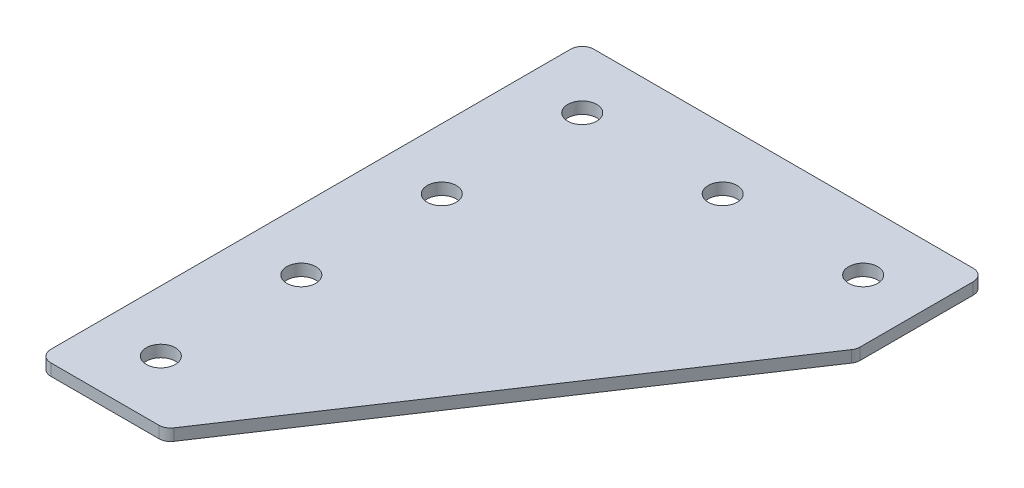
ISO-10303-21;
HEADER;
FILE_DESCRIPTION(('STEP AP214'),'2;1');
FILE_NAME('part.step','',(''),(''),'','','');
FILE_SCHEMA(('AUTOMOTIVE_DESIGN { 1 0 10303 214 1 1 1 1 }'));
ENDSEC;
DATA;
#1=APPLICATION_CONTEXT('core data for automotive mechanical design processes');
#2=APPLICATION_PROTOCOL_DEFINITION('international standard','automotive_design',2000,#1);
#3=PRODUCT_CONTEXT('',#1,'mechanical');
#4=PRODUCT('Part','Part','',(#3));
#5=PRODUCT_RELATED_PRODUCT_CATEGORY('part','',(#4));
#6=PRODUCT_DEFINITION_FORMATION('','',#4);
#7=PRODUCT_DEFINITION_CONTEXT('part definition',#1,'design');
#8=PRODUCT_DEFINITION('design','',#6,#7);
#9=PRODUCT_DEFINITION_SHAPE('','',#8);
#10=(LENGTH_UNIT() NAMED_UNIT(*) SI_UNIT(.MILLI.,.METRE.));
#11=(NAMED_UNIT(*) PLANE_ANGLE_UNIT() SI_UNIT($,.RADIAN.));
#12=(NAMED_UNIT(*) SI_UNIT($,.STERADIAN.) SOLID_ANGLE_UNIT());
#13=UNCERTAINTY_MEASURE_WITH_UNIT(LENGTH_MEASURE(1.E-05),#10,'distance_accuracy_value','');
#14=(GEOMETRIC_REPRESENTATION_CONTEXT(3) GLOBAL_UNCERTAINTY_ASSIGNED_CONTEXT((#13)) GLOBAL_UNIT_ASSIGNED_CONTEXT((#10,
#11,#12)) REPRESENTATION_CONTEXT('',''));
#15=CARTESIAN_POINT('',(0.,0.,0.));
#16=DIRECTION('',(0.,0.,1.));
#17=DIRECTION('',(1.,0.,0.));
#18=AXIS2_PLACEMENT_3D('',#15,#16,#17);
#19=CARTESIAN_POINT('',(-31.3452108311752,1.24134831028641,-46.1457325979904));
#20=DIRECTION('',(0.,-1.,0.));
#21=DIRECTION('',(0.,0.,-1.));
#22=AXIS2_PLACEMENT_3D('',#19,#20,#21);
#23=PLANE('',#22);
#24=CARTESIAN_POINT('',(28.6547891688248,1.24134831028641,-46.1457325979904));
#25=DIRECTION('',(0.,1.,0.));
#26=DIRECTION('',(0.,0.,1.));
#27=AXIS2_PLACEMENT_3D('',#24,#25,#26);
#28=CIRCLE('',#27,3.1);
#29=CARTESIAN_POINT('',(28.6547891688248,1.24134831028641,-43.0457325979904));
#30=VERTEX_POINT('',#29);
#31=EDGE_CURVE('E253',#30,#30,#28,.T.);
#32=ORIENTED_EDGE('',*,*,#31,.T.);
#33=EDGE_LOOP('',(#32));
#34=FACE_BOUND('',#33,.T.);
#35=CARTESIAN_POINT('',(-31.3452108311752,1.24134831028641,43.8542674020096));
#36=DIRECTION('',(0.,1.,0.));
#37=DIRECTION('',(0.,0.,1.));
#38=AXIS2_PLACEMENT_3D('',#35,#36,#37);
#39=CIRCLE('',#38,3.1);
#40=CARTESIAN_POINT('',(-31.3452108311752,1.24134831028641,46.9542674020096));
#41=VERTEX_POINT('',#40);
#42=EDGE_CURVE('E261',#41,#41,#39,.T.);
#43=ORIENTED_EDGE('',*,*,#42,.T.);
#44=EDGE_LOOP('',(#43));
#45=FACE_BOUND('',#44,.T.);
#46=CARTESIAN_POINT('',(-31.3452108311752,1.24134831028641,13.8542674020096));
#47=DIRECTION('',(0.,1.,0.));
#48=DIRECTION('',(0.,0.,1.));
#49=AXIS2_PLACEMENT_3D('',#46,#47,#48);
#50=CIRCLE('',#49,3.1);
#51=CARTESIAN_POINT('',(-31.3452108311752,1.24134831028641,16.9542674020096));
#52=VERTEX_POINT('',#51);
#53=EDGE_CURVE('E267',#52,#52,#50,.T.);
#54=ORIENTED_EDGE('',*,*,#53,.T.);
#55=EDGE_LOOP('',(#54));
#56=FACE_BOUND('',#55,.T.);
#57=CARTESIAN_POINT('',(-31.3452108311752,1.24134831028641,-16.1457325979904));
#58=DIRECTION('',(0.,1.,0.));
#59=DIRECTION('',(0.,0.,1.));
#60=AXIS2_PLACEMENT_3D('',#57,#58,#59);
#61=CIRCLE('',#60,3.1);
#62=CARTESIAN_POINT('',(-31.3452108311752,1.24134831028641,-13.0457325979904));
#63=VERTEX_POINT('',#62);
#64=EDGE_CURVE('E273',#63,#63,#61,.T.);
#65=ORIENTED_EDGE('',*,*,#64,.T.);
#66=EDGE_LOOP('',(#65));
#67=FACE_BOUND('',#66,.T.);
#68=CARTESIAN_POINT('',(-1.34521083117523,1.24134831028641,-46.1457325979904));
#69=DIRECTION('',(0.,1.,0.));
#70=DIRECTION('',(0.,0.,1.));
#71=AXIS2_PLACEMENT_3D('',#68,#69,#70);
#72=CIRCLE('',#71,3.1);
#73=CARTESIAN_POINT('',(-1.34521083117523,1.24134831028641,-43.0457325979904));
#74=VERTEX_POINT('',#73);
#75=EDGE_CURVE('E279',#74,#74,#72,.T.);
#76=ORIENTED_EDGE('',*,*,#75,.T.);
#77=EDGE_LOOP('',(#76));
#78=FACE_BOUND('',#77,.T.);
#79=CARTESIAN_POINT('',(-31.3452108311752,1.24134831028641,-46.1457325979904));
#80=DIRECTION('',(0.,1.,0.));
#81=DIRECTION('',(0.,0.,1.));
#82=AXIS2_PLACEMENT_3D('',#79,#80,#81);
#83=CIRCLE('',#82,3.1);
#84=CARTESIAN_POINT('',(-31.3452108311752,1.24134831028641,-43.0457325979904));
#85=VERTEX_POINT('',#84);
#86=EDGE_CURVE('E176',#85,#85,#83,.T.);
#87=ORIENTED_EDGE('',*,*,#86,.T.);
#88=EDGE_LOOP('',(#87));
#89=FACE_BOUND('',#88,.T.);
#90=DIRECTION('',(1.,0.,0.));
#91=VECTOR('',#90,1.);
#92=CARTESIAN_POINT('',(-44.3452108311753,1.24134831028641,56.8542674020095));
#93=LINE('',#92,#91);
#94=CARTESIAN_POINT('',(-41.8452108311753,1.24134831028641,56.8542674020095));
#95=VERTEX_POINT('',#94);
#96=CARTESIAN_POINT('',(-18.7535377443711,1.24134831028641,56.8542674020095));
#97=VERTEX_POINT('',#96);
#98=EDGE_CURVE('E165',#95,#97,#93,.T.);
#99=ORIENTED_EDGE('',*,*,#98,.F.);
#100=CARTESIAN_POINT('',(-41.8452108311753,1.24134831028641,54.3542674020095));
#101=DIRECTION('',(0.,-1.,0.));
#102=DIRECTION('',(0.,0.,-1.));
#103=AXIS2_PLACEMENT_3D('',#100,#101,#102);
#104=CIRCLE('',#103,2.5);
#105=CARTESIAN_POINT('',(-44.3452108311753,1.24134831028641,54.3542674020095));
#106=VERTEX_POINT('',#105);
#107=EDGE_CURVE('E146',#95,#106,#104,.T.);
#108=ORIENTED_EDGE('',*,*,#107,.T.);
#109=DIRECTION('',(0.,0.,1.));
#110=VECTOR('',#109,1.);
#111=CARTESIAN_POINT('',(-44.3452108311753,1.24134831028641,-59.1457325979904));
#112=LINE('',#111,#110);
#113=CARTESIAN_POINT('',(-44.3452108311753,1.24134831028641,-56.6457325979904));
#114=VERTEX_POINT('',#113);
#115=EDGE_CURVE('E163',#114,#106,#112,.T.);
#116=ORIENTED_EDGE('',*,*,#115,.F.);
#117=CARTESIAN_POINT('',(-41.8452108311753,1.24134831028641,-56.6457325979904));
#118=DIRECTION('',(0.,-1.,0.));
#119=DIRECTION('',(0.,0.,-1.));
#120=AXIS2_PLACEMENT_3D('',#117,#118,#119);
#121=CIRCLE('',#120,2.5);
#122=CARTESIAN_POINT('',(-41.8452108311753,1.24134831028641,-59.1457325979904));
#123=VERTEX_POINT('',#122);
#124=EDGE_CURVE('E117',#114,#123,#121,.T.);
#125=ORIENTED_EDGE('',*,*,#124,.T.);
#126=DIRECTION('',(-1.,0.,0.));
#127=VECTOR('',#126,1.);
#128=CARTESIAN_POINT('',(41.6547891688247,1.24134831028641,-59.1457325979904));
#129=LINE('',#128,#127);
#130=CARTESIAN_POINT('',(39.1547891688247,1.24134831028641,-59.1457325979904));
#131=VERTEX_POINT('',#130);
#132=EDGE_CURVE('E161',#131,#123,#129,.T.);
#133=ORIENTED_EDGE('',*,*,#132,.F.);
#134=CARTESIAN_POINT('',(39.1547891688247,1.24134831028641,-56.6457325979904));
#135=DIRECTION('',(0.,-1.,0.));
#136=DIRECTION('',(0.,0.,-1.));
#137=AXIS2_PLACEMENT_3D('',#134,#135,#136);
#138=CIRCLE('',#137,2.5);
#139=CARTESIAN_POINT('',(41.6547891688247,1.24134831028641,-56.6457325979904));
#140=VERTEX_POINT('',#139);
#141=EDGE_CURVE('E141',#131,#140,#138,.T.);
#142=ORIENTED_EDGE('',*,*,#141,.T.);
#143=DIRECTION('',(0.,0.,-1.));
#144=VECTOR('',#143,1.);
#145=CARTESIAN_POINT('',(41.6547891688247,1.24134831028641,-31.7512838734544));
#146=LINE('',#145,#144);
#147=CARTESIAN_POINT('',(41.6547891688247,1.24134831028641,-32.5082229677844));
#148=VERTEX_POINT('',#147);
#149=EDGE_CURVE('E118',#148,#140,#146,.T.);
#150=ORIENTED_EDGE('',*,*,#149,.F.);
#151=CARTESIAN_POINT('',(39.1547891688247,1.24134831028641,-32.5082229677844));
#152=DIRECTION('',(0.,-1.,0.));
#153=DIRECTION('',(0.,0.,-1.));
#154=AXIS2_PLACEMENT_3D('',#151,#152,#153);
#155=CIRCLE('',#154,2.5);
#156=CARTESIAN_POINT('',(41.2349149046693,1.24134831028641,-31.1214724772213));
#157=VERTEX_POINT('',#156);
#158=EDGE_CURVE('E31',#148,#157,#155,.T.);
#159=ORIENTED_EDGE('',*,*,#158,.T.);
#160=DIRECTION('',(0.554700196225228,0.,-0.832050294337844));
#161=VECTOR('',#160,1.);
#162=CARTESIAN_POINT('',(-17.4155783481511,1.24134831028641,56.8542674020095));
#163=LINE('',#162,#161);
#164=CARTESIAN_POINT('',(-16.6734120085265,1.24134831028641,55.7410178925726));
#165=VERTEX_POINT('',#164);
#166=EDGE_CURVE('E122',#165,#157,#163,.T.);
#167=ORIENTED_EDGE('',*,*,#166,.F.);
#168=CARTESIAN_POINT('',(-18.7535377443711,1.24134831028641,54.3542674020095));
#169=DIRECTION('',(0.,-1.,0.));
#170=DIRECTION('',(0.,0.,-1.));
#171=AXIS2_PLACEMENT_3D('',#168,#169,#170);
#172=CIRCLE('',#171,2.5);
#173=EDGE_CURVE('E144',#165,#97,#172,.T.);
#174=ORIENTED_EDGE('',*,*,#173,.T.);
#175=EDGE_LOOP('',(#99,#108,#116,#125,#133,#142,#150,#159,#167,#174));
#176=FACE_BOUND('',#175,.T.);
#177=ADVANCED_FACE('F16',(#34,#45,#56,#67,#78,#89,#176),#23,.T.);
#178=CARTESIAN_POINT('',(41.6547891688247,1.24134831028641,-59.1457325979904));
#179=DIRECTION('',(0.,0.,-1.));
#180=DIRECTION('',(-1.,0.,0.));
#181=AXIS2_PLACEMENT_3D('',#178,#179,#180);
#182=PLANE('',#181);
#183=DIRECTION('',(-1.,0.,0.));
#184=VECTOR('',#183,1.);
#185=CARTESIAN_POINT('',(41.6547891688247,3.74134831028641,-59.1457325979904));
#186=LINE('',#185,#184);
#187=CARTESIAN_POINT('',(39.1547891688247,3.74134831028641,-59.1457325979904));
#188=VERTEX_POINT('',#187);
#189=CARTESIAN_POINT('',(-41.8452108311753,3.74134831028641,-59.1457325979904));
#190=VERTEX_POINT('',#189);
#191=EDGE_CURVE('E99',#188,#190,#186,.T.);
#192=ORIENTED_EDGE('',*,*,#191,.F.);
#193=DIRECTION('',(0.,1.,0.));
#194=VECTOR('',#193,1.);
#195=CARTESIAN_POINT('',(39.1547891688247,1.24134831028641,-59.1457325979904));
#196=LINE('',#195,#194);
#197=EDGE_CURVE('E10',#188,#131,#196,.F.);
#198=ORIENTED_EDGE('',*,*,#197,.T.);
#199=ORIENTED_EDGE('',*,*,#132,.T.);
#200=DIRECTION('',(0.,1.,0.));
#201=VECTOR('',#200,1.);
#202=CARTESIAN_POINT('',(-41.8452108311753,1.24134831028641,-59.1457325979904));
#203=LINE('',#202,#201);
#204=EDGE_CURVE('E24',#123,#190,#203,.T.);
#205=ORIENTED_EDGE('',*,*,#204,.T.);
#206=EDGE_LOOP('',(#192,#198,#199,#205));
#207=FACE_BOUND('',#206,.T.);
#208=ADVANCED_FACE('F158',(#207),#182,.T.);
#209=CARTESIAN_POINT('',(41.6547891688247,1.24134831028641,-31.7512838734544));
#210=DIRECTION('',(1.,0.,0.));
#211=DIRECTION('',(0.,0.,-1.));
#212=AXIS2_PLACEMENT_3D('',#209,#210,#211);
#213=PLANE('',#212);
#214=DIRECTION('',(0.,0.,-1.));
#215=VECTOR('',#214,1.);
#216=CARTESIAN_POINT('',(41.6547891688247,3.74134831028641,-31.7512838734544));
#217=LINE('',#216,#215);
#218=CARTESIAN_POINT('',(41.6547891688247,3.74134831028641,-32.5082229677844));
#219=VERTEX_POINT('',#218);
#220=CARTESIAN_POINT('',(41.6547891688247,3.74134831028641,-56.6457325979904));
#221=VERTEX_POINT('',#220);
#222=EDGE_CURVE('E125',#219,#221,#217,.T.);
#223=ORIENTED_EDGE('',*,*,#222,.F.);
#224=DIRECTION('',(0.,1.,0.));
#225=VECTOR('',#224,1.);
#226=CARTESIAN_POINT('',(41.6547891688247,1.24134831028641,-32.5082229677844));
#227=LINE('',#226,#225);
#228=EDGE_CURVE('E155',#219,#148,#227,.F.);
#229=ORIENTED_EDGE('',*,*,#228,.T.);
#230=ORIENTED_EDGE('',*,*,#149,.T.);
#231=DIRECTION('',(0.,1.,0.));
#232=VECTOR('',#231,1.);
#233=CARTESIAN_POINT('',(41.6547891688247,1.24134831028641,-56.6457325979904));
#234=LINE('',#233,#232);
#235=EDGE_CURVE('E152',#140,#221,#234,.T.);
#236=ORIENTED_EDGE('',*,*,#235,.T.);
#237=EDGE_LOOP('',(#223,#229,#230,#236));
#238=FACE_BOUND('',#237,.T.);
#239=ADVANCED_FACE('F212',(#238),#213,.T.);
#240=CARTESIAN_POINT('',(-17.4155783481511,1.24134831028641,56.8542674020095));
#241=DIRECTION('',(0.832050294337844,0.,0.554700196225228));
#242=DIRECTION('',(0.554700196225228,0.,-0.832050294337845));
#243=AXIS2_PLACEMENT_3D('',#240,#241,#242);
#244=PLANE('',#243);
#245=DIRECTION('',(0.554700196225228,0.,-0.832050294337844));
#246=VECTOR('',#245,1.);
#247=CARTESIAN_POINT('',(-17.4155783481511,3.74134831028641,56.8542674020095));
#248=LINE('',#247,#246);
#249=CARTESIAN_POINT('',(-16.6734120085265,3.74134831028641,55.7410178925726));
#250=VERTEX_POINT('',#249);
#251=CARTESIAN_POINT('',(41.2349149046693,3.74134831028641,-31.1214724772213));
#252=VERTEX_POINT('',#251);
#253=EDGE_CURVE('E168',#250,#252,#248,.T.);
#254=ORIENTED_EDGE('',*,*,#253,.F.);
#255=DIRECTION('',(0.,1.,0.));
#256=VECTOR('',#255,1.);
#257=CARTESIAN_POINT('',(-16.6734120085265,1.24134831028641,55.7410178925726));
#258=LINE('',#257,#256);
#259=EDGE_CURVE('E38',#250,#165,#258,.F.);
#260=ORIENTED_EDGE('',*,*,#259,.T.);
#261=ORIENTED_EDGE('',*,*,#166,.T.);
#262=DIRECTION('',(0.,1.,0.));
#263=VECTOR('',#262,1.);
#264=CARTESIAN_POINT('',(41.2349149046693,1.24134831028641,-31.1214724772213));
#265=LINE('',#264,#263);
#266=EDGE_CURVE('E148',#157,#252,#265,.T.);
#267=ORIENTED_EDGE('',*,*,#266,.T.);
#268=EDGE_LOOP('',(#254,#260,#261,#267));
#269=FACE_BOUND('',#268,.T.);
#270=ADVANCED_FACE('F181',(#269),#244,.T.);
#271=CARTESIAN_POINT('',(-44.3452108311753,1.24134831028641,56.8542674020095));
#272=DIRECTION('',(0.,0.,1.));
#273=DIRECTION('',(1.,0.,0.));
#274=AXIS2_PLACEMENT_3D('',#271,#272,#273);
#275=PLANE('',#274);
#276=DIRECTION('',(1.,0.,0.));
#277=VECTOR('',#276,1.);
#278=CARTESIAN_POINT('',(-44.3452108311753,3.74134831028641,56.8542674020095));
#279=LINE('',#278,#277);
#280=CARTESIAN_POINT('',(-41.8452108311753,3.74134831028641,56.8542674020095));
#281=VERTEX_POINT('',#280);
#282=CARTESIAN_POINT('',(-18.7535377443711,3.74134831028641,56.8542674020095));
#283=VERTEX_POINT('',#282);
#284=EDGE_CURVE('E114',#281,#283,#279,.T.);
#285=ORIENTED_EDGE('',*,*,#284,.F.);
#286=DIRECTION('',(0.,1.,0.));
#287=VECTOR('',#286,1.);
#288=CARTESIAN_POINT('',(-41.8452108311753,1.24134831028641,56.8542674020095));
#289=LINE('',#288,#287);
#290=EDGE_CURVE('E138',#281,#95,#289,.F.);
#291=ORIENTED_EDGE('',*,*,#290,.T.);
#292=ORIENTED_EDGE('',*,*,#98,.T.);
#293=DIRECTION('',(0.,1.,0.));
#294=VECTOR('',#293,1.);
#295=CARTESIAN_POINT('',(-18.7535377443711,1.24134831028641,56.8542674020095));
#296=LINE('',#295,#294);
#297=EDGE_CURVE('E135',#97,#283,#296,.T.);
#298=ORIENTED_EDGE('',*,*,#297,.T.);
#299=EDGE_LOOP('',(#285,#291,#292,#298));
#300=FACE_BOUND('',#299,.T.);
#301=ADVANCED_FACE('F191',(#300),#275,.T.);
#302=CARTESIAN_POINT('',(-44.3452108311753,1.24134831028641,-59.1457325979904));
#303=DIRECTION('',(-1.,0.,0.));
#304=DIRECTION('',(0.,0.,1.));
#305=AXIS2_PLACEMENT_3D('',#302,#303,#304);
#306=PLANE('',#305);
#307=ORIENTED_EDGE('',*,*,#115,.T.);
#308=DIRECTION('',(0.,1.,0.));
#309=VECTOR('',#308,1.);
#310=CARTESIAN_POINT('',(-44.3452108311753,1.24134831028641,54.3542674020095));
#311=LINE('',#310,#309);
#312=CARTESIAN_POINT('',(-44.3452108311753,3.74134831028641,54.3542674020095));
#313=VERTEX_POINT('',#312);
#314=EDGE_CURVE('E105',#106,#313,#311,.T.);
#315=ORIENTED_EDGE('',*,*,#314,.T.);
#316=DIRECTION('',(0.,0.,1.));
#317=VECTOR('',#316,1.);
#318=CARTESIAN_POINT('',(-44.3452108311753,3.74134831028641,-59.1457325979904));
#319=LINE('',#318,#317);
#320=CARTESIAN_POINT('',(-44.3452108311753,3.74134831028641,-56.6457325979904));
#321=VERTEX_POINT('',#320);
#322=EDGE_CURVE('E97',#321,#313,#319,.T.);
#323=ORIENTED_EDGE('',*,*,#322,.F.);
#324=DIRECTION('',(0.,1.,0.));
#325=VECTOR('',#324,1.);
#326=CARTESIAN_POINT('',(-44.3452108311753,1.24134831028641,-56.6457325979904));
#327=LINE('',#326,#325);
#328=EDGE_CURVE('E111',#321,#114,#327,.F.);
#329=ORIENTED_EDGE('',*,*,#328,.T.);
#330=EDGE_LOOP('',(#307,#315,#323,#329));
#331=FACE_BOUND('',#330,.T.);
#332=ADVANCED_FACE('F110',(#331),#306,.T.);
#333=CARTESIAN_POINT('',(-31.3452108311752,3.74134831028641,-46.1457325979904));
#334=DIRECTION('',(0.,-1.,0.));
#335=DIRECTION('',(0.,0.,-1.));
#336=AXIS2_PLACEMENT_3D('',#333,#334,#335);
#337=PLANE('',#336);
#338=CARTESIAN_POINT('',(28.6547891688248,3.74134831028641,-46.1457325979904));
#339=DIRECTION('',(0.,1.,0.));
#340=DIRECTION('',(0.,0.,1.));
#341=AXIS2_PLACEMENT_3D('',#338,#339,#340);
#342=CIRCLE('',#341,3.1);
#343=CARTESIAN_POINT('',(28.6547891688248,3.74134831028641,-43.0457325979904));
#344=VERTEX_POINT('',#343);
#345=EDGE_CURVE('E256',#344,#344,#342,.T.);
#346=ORIENTED_EDGE('',*,*,#345,.F.);
#347=EDGE_LOOP('',(#346));
#348=FACE_BOUND('',#347,.T.);
#349=CARTESIAN_POINT('',(-31.3452108311752,3.74134831028641,43.8542674020096));
#350=DIRECTION('',(0.,1.,0.));
#351=DIRECTION('',(0.,0.,1.));
#352=AXIS2_PLACEMENT_3D('',#349,#350,#351);
#353=CIRCLE('',#352,3.1);
#354=CARTESIAN_POINT('',(-31.3452108311752,3.74134831028641,46.9542674020096));
#355=VERTEX_POINT('',#354);
#356=EDGE_CURVE('E258',#355,#355,#353,.T.);
#357=ORIENTED_EDGE('',*,*,#356,.F.);
#358=EDGE_LOOP('',(#357));
#359=FACE_BOUND('',#358,.T.);
#360=CARTESIAN_POINT('',(-31.3452108311752,3.74134831028641,13.8542674020096));
#361=DIRECTION('',(0.,1.,0.));
#362=DIRECTION('',(0.,0.,1.));
#363=AXIS2_PLACEMENT_3D('',#360,#361,#362);
#364=CIRCLE('',#363,3.1);
#365=CARTESIAN_POINT('',(-31.3452108311752,3.74134831028641,16.9542674020096));
#366=VERTEX_POINT('',#365);
#367=EDGE_CURVE('E264',#366,#366,#364,.T.);
#368=ORIENTED_EDGE('',*,*,#367,.F.);
#369=EDGE_LOOP('',(#368));
#370=FACE_BOUND('',#369,.T.);
#371=CARTESIAN_POINT('',(-31.3452108311752,3.74134831028641,-16.1457325979904));
#372=DIRECTION('',(0.,1.,0.));
#373=DIRECTION('',(0.,0.,1.));
#374=AXIS2_PLACEMENT_3D('',#371,#372,#373);
#375=CIRCLE('',#374,3.1);
#376=CARTESIAN_POINT('',(-31.3452108311752,3.74134831028641,-13.0457325979904));
#377=VERTEX_POINT('',#376);
#378=EDGE_CURVE('E270',#377,#377,#375,.T.);
#379=ORIENTED_EDGE('',*,*,#378,.F.);
#380=EDGE_LOOP('',(#379));
#381=FACE_BOUND('',#380,.T.);
#382=CARTESIAN_POINT('',(-1.34521083117523,3.74134831028641,-46.1457325979904));
#383=DIRECTION('',(0.,1.,0.));
#384=DIRECTION('',(0.,0.,1.));
#385=AXIS2_PLACEMENT_3D('',#382,#383,#384);
#386=CIRCLE('',#385,3.1);
#387=CARTESIAN_POINT('',(-1.34521083117523,3.74134831028641,-43.0457325979904));
#388=VERTEX_POINT('',#387);
#389=EDGE_CURVE('E276',#388,#388,#386,.T.);
#390=ORIENTED_EDGE('',*,*,#389,.F.);
#391=EDGE_LOOP('',(#390));
#392=FACE_BOUND('',#391,.T.);
#393=CARTESIAN_POINT('',(-31.3452108311752,3.74134831028641,-46.1457325979904));
#394=DIRECTION('',(0.,1.,0.));
#395=DIRECTION('',(0.,0.,1.));
#396=AXIS2_PLACEMENT_3D('',#393,#394,#395);
#397=CIRCLE('',#396,3.1);
#398=CARTESIAN_POINT('',(-31.3452108311752,3.74134831028641,-43.0457325979904));
#399=VERTEX_POINT('',#398);
#400=EDGE_CURVE('E170',#399,#399,#397,.T.);
#401=ORIENTED_EDGE('',*,*,#400,.F.);
#402=EDGE_LOOP('',(#401));
#403=FACE_BOUND('',#402,.T.);
#404=ORIENTED_EDGE('',*,*,#322,.T.);
#405=CARTESIAN_POINT('',(-41.8452108311753,3.74134831028641,54.3542674020095));
#406=DIRECTION('',(0.,-1.,0.));
#407=DIRECTION('',(0.,0.,-1.));
#408=AXIS2_PLACEMENT_3D('',#405,#406,#407);
#409=CIRCLE('',#408,2.5);
#410=EDGE_CURVE('E133',#313,#281,#409,.F.);
#411=ORIENTED_EDGE('',*,*,#410,.T.);
#412=ORIENTED_EDGE('',*,*,#284,.T.);
#413=CARTESIAN_POINT('',(-18.7535377443711,3.74134831028641,54.3542674020095));
#414=DIRECTION('',(0.,-1.,0.));
#415=DIRECTION('',(0.,0.,-1.));
#416=AXIS2_PLACEMENT_3D('',#413,#414,#415);
#417=CIRCLE('',#416,2.5);
#418=EDGE_CURVE('E131',#283,#250,#417,.F.);
#419=ORIENTED_EDGE('',*,*,#418,.T.);
#420=ORIENTED_EDGE('',*,*,#253,.T.);
#421=CARTESIAN_POINT('',(39.1547891688247,3.74134831028641,-32.5082229677844));
#422=DIRECTION('',(0.,-1.,0.));
#423=DIRECTION('',(0.,0.,-1.));
#424=AXIS2_PLACEMENT_3D('',#421,#422,#423);
#425=CIRCLE('',#424,2.5);
#426=EDGE_CURVE('E129',#252,#219,#425,.F.);
#427=ORIENTED_EDGE('',*,*,#426,.T.);
#428=ORIENTED_EDGE('',*,*,#222,.T.);
#429=CARTESIAN_POINT('',(39.1547891688247,3.74134831028641,-56.6457325979904));
#430=DIRECTION('',(0.,-1.,0.));
#431=DIRECTION('',(0.,0.,-1.));
#432=AXIS2_PLACEMENT_3D('',#429,#430,#431);
#433=CIRCLE('',#432,2.5);
#434=EDGE_CURVE('E104',#221,#188,#433,.F.);
#435=ORIENTED_EDGE('',*,*,#434,.T.);
#436=ORIENTED_EDGE('',*,*,#191,.T.);
#437=CARTESIAN_POINT('',(-41.8452108311753,3.74134831028641,-56.6457325979904));
#438=DIRECTION('',(0.,-1.,0.));
#439=DIRECTION('',(0.,0.,-1.));
#440=AXIS2_PLACEMENT_3D('',#437,#438,#439);
#441=CIRCLE('',#440,2.5);
#442=EDGE_CURVE('E94',#190,#321,#441,.F.);
#443=ORIENTED_EDGE('',*,*,#442,.T.);
#444=EDGE_LOOP('',(#404,#411,#412,#419,#420,#427,#428,#435,#436,#443));
#445=FACE_BOUND('',#444,.T.);
#446=ADVANCED_FACE('F96',(#348,#359,#370,#381,#392,#403,#445),#337,.F.);
#447=CARTESIAN_POINT('',(-41.8452108311753,1.24134831028641,54.3542674020095));
#448=DIRECTION('',(0.,1.,0.));
#449=DIRECTION('',(0.,0.,1.));
#450=AXIS2_PLACEMENT_3D('',#447,#448,#449);
#451=CYLINDRICAL_SURFACE('',#450,2.5);
#452=ORIENTED_EDGE('',*,*,#107,.F.);
#453=ORIENTED_EDGE('',*,*,#290,.F.);
#454=ORIENTED_EDGE('',*,*,#410,.F.);
#455=ORIENTED_EDGE('',*,*,#314,.F.);
#456=EDGE_LOOP('',(#452,#453,#454,#455));
#457=FACE_BOUND('',#456,.T.);
#458=ADVANCED_FACE('F194',(#457),#451,.T.);
#459=CARTESIAN_POINT('',(-18.7535377443711,1.24134831028641,54.3542674020095));
#460=DIRECTION('',(0.,1.,0.));
#461=DIRECTION('',(0.,0.,1.));
#462=AXIS2_PLACEMENT_3D('',#459,#460,#461);
#463=CYLINDRICAL_SURFACE('',#462,2.5);
#464=ORIENTED_EDGE('',*,*,#173,.F.);
#465=ORIENTED_EDGE('',*,*,#259,.F.);
#466=ORIENTED_EDGE('',*,*,#418,.F.);
#467=ORIENTED_EDGE('',*,*,#297,.F.);
#468=EDGE_LOOP('',(#464,#465,#466,#467));
#469=FACE_BOUND('',#468,.T.);
#470=ADVANCED_FACE('F185',(#469),#463,.T.);
#471=CARTESIAN_POINT('',(39.1547891688247,1.24134831028641,-32.5082229677844));
#472=DIRECTION('',(0.,1.,0.));
#473=DIRECTION('',(0.,0.,1.));
#474=AXIS2_PLACEMENT_3D('',#471,#472,#473);
#475=CYLINDRICAL_SURFACE('',#474,2.5);
#476=ORIENTED_EDGE('',*,*,#158,.F.);
#477=ORIENTED_EDGE('',*,*,#228,.F.);
#478=ORIENTED_EDGE('',*,*,#426,.F.);
#479=ORIENTED_EDGE('',*,*,#266,.F.);
#480=EDGE_LOOP('',(#476,#477,#478,#479));
#481=FACE_BOUND('',#480,.T.);
#482=ADVANCED_FACE('F202',(#481),#475,.T.);
#483=CARTESIAN_POINT('',(39.1547891688247,1.24134831028641,-56.6457325979904));
#484=DIRECTION('',(0.,1.,0.));
#485=DIRECTION('',(0.,0.,1.));
#486=AXIS2_PLACEMENT_3D('',#483,#484,#485);
#487=CYLINDRICAL_SURFACE('',#486,2.5);
#488=ORIENTED_EDGE('',*,*,#141,.F.);
#489=ORIENTED_EDGE('',*,*,#197,.F.);
#490=ORIENTED_EDGE('',*,*,#434,.F.);
#491=ORIENTED_EDGE('',*,*,#235,.F.);
#492=EDGE_LOOP('',(#488,#489,#490,#491));
#493=FACE_BOUND('',#492,.T.);
#494=ADVANCED_FACE('F337',(#493),#487,.T.);
#495=CARTESIAN_POINT('',(-41.8452108311753,1.24134831028641,-56.6457325979904));
#496=DIRECTION('',(0.,1.,0.));
#497=DIRECTION('',(0.,0.,1.));
#498=AXIS2_PLACEMENT_3D('',#495,#496,#497);
#499=CYLINDRICAL_SURFACE('',#498,2.5);
#500=ORIENTED_EDGE('',*,*,#124,.F.);
#501=ORIENTED_EDGE('',*,*,#328,.F.);
#502=ORIENTED_EDGE('',*,*,#442,.F.);
#503=ORIENTED_EDGE('',*,*,#204,.F.);
#504=EDGE_LOOP('',(#500,#501,#502,#503));
#505=FACE_BOUND('',#504,.T.);
#506=ADVANCED_FACE('F18',(#505),#499,.T.);
#507=CARTESIAN_POINT('',(-31.3452108311752,1.24134831028641,-46.1457325979904));
#508=DIRECTION('',(0.,1.,0.));
#509=DIRECTION('',(0.,0.,1.));
#510=AXIS2_PLACEMENT_3D('',#507,#508,#509);
#511=CYLINDRICAL_SURFACE('',#510,3.1);
#512=ORIENTED_EDGE('',*,*,#86,.F.);
#513=EDGE_LOOP('',(#512));
#514=FACE_BOUND('',#513,.T.);
#515=ORIENTED_EDGE('',*,*,#400,.T.);
#516=EDGE_LOOP('',(#515));
#517=FACE_BOUND('',#516,.T.);
#518=ADVANCED_FACE('F226',(#514,#517),#511,.F.);
#519=CARTESIAN_POINT('',(-1.34521083117523,1.24134831028641,-46.1457325979904));
#520=DIRECTION('',(0.,1.,0.));
#521=DIRECTION('',(0.,0.,1.));
#522=AXIS2_PLACEMENT_3D('',#519,#520,#521);
#523=CYLINDRICAL_SURFACE('',#522,3.1);
#524=ORIENTED_EDGE('',*,*,#75,.F.);
#525=EDGE_LOOP('',(#524));
#526=FACE_BOUND('',#525,.T.);
#527=ORIENTED_EDGE('',*,*,#389,.T.);
#528=EDGE_LOOP('',(#527));
#529=FACE_BOUND('',#528,.T.);
#530=ADVANCED_FACE('F229',(#526,#529),#523,.F.);
#531=CARTESIAN_POINT('',(-31.3452108311752,1.24134831028641,-16.1457325979904));
#532=DIRECTION('',(0.,1.,0.));
#533=DIRECTION('',(0.,0.,1.));
#534=AXIS2_PLACEMENT_3D('',#531,#532,#533);
#535=CYLINDRICAL_SURFACE('',#534,3.1);
#536=ORIENTED_EDGE('',*,*,#64,.F.);
#537=EDGE_LOOP('',(#536));
#538=FACE_BOUND('',#537,.T.);
#539=ORIENTED_EDGE('',*,*,#378,.T.);
#540=EDGE_LOOP('',(#539));
#541=FACE_BOUND('',#540,.T.);
#542=ADVANCED_FACE('F233',(#538,#541),#535,.F.);
#543=CARTESIAN_POINT('',(-31.3452108311752,1.24134831028641,13.8542674020096));
#544=DIRECTION('',(0.,1.,0.));
#545=DIRECTION('',(0.,0.,1.));
#546=AXIS2_PLACEMENT_3D('',#543,#544,#545);
#547=CYLINDRICAL_SURFACE('',#546,3.1);
#548=ORIENTED_EDGE('',*,*,#53,.F.);
#549=EDGE_LOOP('',(#548));
#550=FACE_BOUND('',#549,.T.);
#551=ORIENTED_EDGE('',*,*,#367,.T.);
#552=EDGE_LOOP('',(#551));
#553=FACE_BOUND('',#552,.T.);
#554=ADVANCED_FACE('F237',(#550,#553),#547,.F.);
#555=CARTESIAN_POINT('',(-31.3452108311752,1.24134831028641,43.8542674020096));
#556=DIRECTION('',(0.,1.,0.));
#557=DIRECTION('',(0.,0.,1.));
#558=AXIS2_PLACEMENT_3D('',#555,#556,#557);
#559=CYLINDRICAL_SURFACE('',#558,3.1);
#560=ORIENTED_EDGE('',*,*,#42,.F.);
#561=EDGE_LOOP('',(#560));
#562=FACE_BOUND('',#561,.T.);
#563=ORIENTED_EDGE('',*,*,#356,.T.);
#564=EDGE_LOOP('',(#563));
#565=FACE_BOUND('',#564,.T.);
#566=ADVANCED_FACE('F241',(#562,#565),#559,.F.);
#567=CARTESIAN_POINT('',(28.6547891688248,1.24134831028641,-46.1457325979904));
#568=DIRECTION('',(0.,1.,0.));
#569=DIRECTION('',(0.,0.,1.));
#570=AXIS2_PLACEMENT_3D('',#567,#568,#569);
#571=CYLINDRICAL_SURFACE('',#570,3.1);
#572=ORIENTED_EDGE('',*,*,#31,.F.);
#573=EDGE_LOOP('',(#572));
#574=FACE_BOUND('',#573,.T.);
#575=ORIENTED_EDGE('',*,*,#345,.T.);
#576=EDGE_LOOP('',(#575));
#577=FACE_BOUND('',#576,.T.);
#578=ADVANCED_FACE('F245',(#574,#577),#571,.F.);
#579=CLOSED_SHELL('',(#177,#208,#239,#270,#301,#332,#446,#458,#470,#482,#494,#506,#518,#530,
#542,#554,#566,#578));
#580=MANIFOLD_SOLID_BREP('B1',#579);
#581=ADVANCED_BREP_SHAPE_REPRESENTATION('',(#18,#580),#14);
#582=SHAPE_DEFINITION_REPRESENTATION(#9,#581);
ENDSEC;
END-ISO-10303-21;
